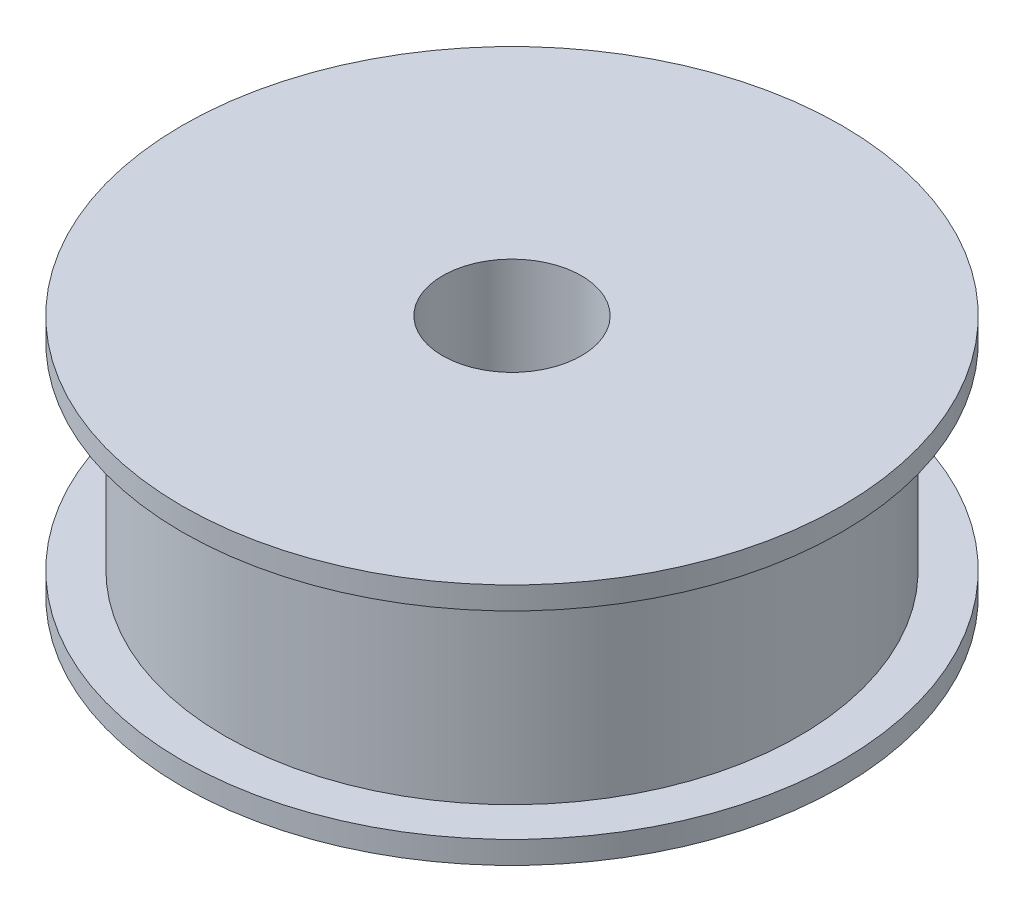
ISO-10303-21;
HEADER;
FILE_DESCRIPTION(('STEP AP214'),'2;1');
FILE_NAME('part.step','',(''),(''),'','','');
FILE_SCHEMA(('AUTOMOTIVE_DESIGN { 1 0 10303 214 1 1 1 1 }'));
ENDSEC;
DATA;
#1=APPLICATION_CONTEXT('core data for automotive mechanical design processes');
#2=APPLICATION_PROTOCOL_DEFINITION('international standard','automotive_design',2000,#1);
#3=PRODUCT_CONTEXT('',#1,'mechanical');
#4=PRODUCT('Part','Part','',(#3));
#5=PRODUCT_RELATED_PRODUCT_CATEGORY('part','',(#4));
#6=PRODUCT_DEFINITION_FORMATION('','',#4);
#7=PRODUCT_DEFINITION_CONTEXT('part definition',#1,'design');
#8=PRODUCT_DEFINITION('design','',#6,#7);
#9=PRODUCT_DEFINITION_SHAPE('','',#8);
#10=(LENGTH_UNIT() NAMED_UNIT(*) SI_UNIT(.MILLI.,.METRE.));
#11=(NAMED_UNIT(*) PLANE_ANGLE_UNIT() SI_UNIT($,.RADIAN.));
#12=(NAMED_UNIT(*) SI_UNIT($,.STERADIAN.) SOLID_ANGLE_UNIT());
#13=UNCERTAINTY_MEASURE_WITH_UNIT(LENGTH_MEASURE(1.E-05),#10,'distance_accuracy_value','');
#14=(GEOMETRIC_REPRESENTATION_CONTEXT(3) GLOBAL_UNCERTAINTY_ASSIGNED_CONTEXT((#13)) GLOBAL_UNIT_ASSIGNED_CONTEXT((#10,
#11,#12)) REPRESENTATION_CONTEXT('',''));
#15=CARTESIAN_POINT('',(0.,0.,0.));
#16=DIRECTION('',(0.,0.,1.));
#17=DIRECTION('',(1.,0.,0.));
#18=AXIS2_PLACEMENT_3D('',#15,#16,#17);
#19=CARTESIAN_POINT('',(0.,7.7,0.));
#20=DIRECTION('',(0.,1.,0.));
#21=DIRECTION('',(0.,0.,1.));
#22=AXIS2_PLACEMENT_3D('',#19,#20,#21);
#23=CYLINDRICAL_SURFACE('',#22,19.);
#24=CARTESIAN_POINT('',(0.,-7.,0.));
#25=DIRECTION('',(0.,1.,0.));
#26=DIRECTION('',(0.,0.,1.));
#27=AXIS2_PLACEMENT_3D('',#24,#25,#26);
#28=CIRCLE('',#27,19.);
#29=CARTESIAN_POINT('',(0.,-7.,19.));
#30=VERTEX_POINT('',#29);
#31=EDGE_CURVE('E72',#30,#30,#28,.T.);
#32=ORIENTED_EDGE('',*,*,#31,.T.);
#33=EDGE_LOOP('',(#32));
#34=FACE_BOUND('',#33,.T.);
#35=CARTESIAN_POINT('',(0.,-5.7,0.));
#36=DIRECTION('',(0.,1.,0.));
#37=DIRECTION('',(0.,0.,1.));
#38=AXIS2_PLACEMENT_3D('',#35,#36,#37);
#39=CIRCLE('',#38,19.);
#40=CARTESIAN_POINT('',(0.,-5.7,19.));
#41=VERTEX_POINT('',#40);
#42=EDGE_CURVE('E10',#41,#41,#39,.T.);
#43=ORIENTED_EDGE('',*,*,#42,.F.);
#44=EDGE_LOOP('',(#43));
#45=FACE_BOUND('',#44,.T.);
#46=ADVANCED_FACE('F37',(#34,#45),#23,.T.);
#47=CARTESIAN_POINT('',(0.,-5.7,19.));
#48=DIRECTION('',(0.,1.,0.));
#49=DIRECTION('',(0.,0.,1.));
#50=AXIS2_PLACEMENT_3D('',#47,#48,#49);
#51=PLANE('',#50);
#52=ORIENTED_EDGE('',*,*,#42,.T.);
#53=EDGE_LOOP('',(#52));
#54=FACE_BOUND('',#53,.T.);
#55=CARTESIAN_POINT('',(0.,-5.7,0.));
#56=DIRECTION('',(0.,1.,0.));
#57=DIRECTION('',(0.,0.,1.));
#58=AXIS2_PLACEMENT_3D('',#55,#56,#57);
#59=CIRCLE('',#58,16.55);
#60=CARTESIAN_POINT('',(0.,-5.7,16.55));
#61=VERTEX_POINT('',#60);
#62=EDGE_CURVE('E44',#61,#61,#59,.T.);
#63=ORIENTED_EDGE('',*,*,#62,.F.);
#64=EDGE_LOOP('',(#63));
#65=FACE_BOUND('',#64,.T.);
#66=ADVANCED_FACE('F91',(#54,#65),#51,.T.);
#67=CARTESIAN_POINT('',(0.,7.7,0.));
#68=DIRECTION('',(0.,1.,0.));
#69=DIRECTION('',(0.,0.,1.));
#70=AXIS2_PLACEMENT_3D('',#67,#68,#69);
#71=CYLINDRICAL_SURFACE('',#70,16.55);
#72=ORIENTED_EDGE('',*,*,#62,.T.);
#73=EDGE_LOOP('',(#72));
#74=FACE_BOUND('',#73,.T.);
#75=CARTESIAN_POINT('',(0.,5.7,0.));
#76=DIRECTION('',(0.,1.,0.));
#77=DIRECTION('',(0.,0.,1.));
#78=AXIS2_PLACEMENT_3D('',#75,#76,#77);
#79=CIRCLE('',#78,16.55);
#80=CARTESIAN_POINT('',(0.,5.7,16.55));
#81=VERTEX_POINT('',#80);
#82=EDGE_CURVE('E49',#81,#81,#79,.T.);
#83=ORIENTED_EDGE('',*,*,#82,.F.);
#84=EDGE_LOOP('',(#83));
#85=FACE_BOUND('',#84,.T.);
#86=ADVANCED_FACE('F95',(#74,#85),#71,.T.);
#87=CARTESIAN_POINT('',(0.,5.7,19.));
#88=DIRECTION('',(0.,-1.,0.));
#89=DIRECTION('',(0.,0.,-1.));
#90=AXIS2_PLACEMENT_3D('',#87,#88,#89);
#91=PLANE('',#90);
#92=ORIENTED_EDGE('',*,*,#82,.T.);
#93=EDGE_LOOP('',(#92));
#94=FACE_BOUND('',#93,.T.);
#95=CARTESIAN_POINT('',(0.,5.7,0.));
#96=DIRECTION('',(0.,1.,0.));
#97=DIRECTION('',(0.,0.,1.));
#98=AXIS2_PLACEMENT_3D('',#95,#96,#97);
#99=CIRCLE('',#98,19.);
#100=CARTESIAN_POINT('',(0.,5.7,19.));
#101=VERTEX_POINT('',#100);
#102=EDGE_CURVE('E54',#101,#101,#99,.T.);
#103=ORIENTED_EDGE('',*,*,#102,.F.);
#104=EDGE_LOOP('',(#103));
#105=FACE_BOUND('',#104,.T.);
#106=ADVANCED_FACE('F99',(#94,#105),#91,.T.);
#107=CARTESIAN_POINT('',(0.,7.7,0.));
#108=DIRECTION('',(0.,1.,0.));
#109=DIRECTION('',(0.,0.,1.));
#110=AXIS2_PLACEMENT_3D('',#107,#108,#109);
#111=CYLINDRICAL_SURFACE('',#110,19.);
#112=ORIENTED_EDGE('',*,*,#102,.T.);
#113=EDGE_LOOP('',(#112));
#114=FACE_BOUND('',#113,.T.);
#115=CARTESIAN_POINT('',(0.,7.,0.));
#116=DIRECTION('',(0.,1.,0.));
#117=DIRECTION('',(0.,0.,1.));
#118=AXIS2_PLACEMENT_3D('',#115,#116,#117);
#119=CIRCLE('',#118,19.);
#120=CARTESIAN_POINT('',(0.,7.,19.));
#121=VERTEX_POINT('',#120);
#122=EDGE_CURVE('E60',#121,#121,#119,.T.);
#123=ORIENTED_EDGE('',*,*,#122,.F.);
#124=EDGE_LOOP('',(#123));
#125=FACE_BOUND('',#124,.T.);
#126=ADVANCED_FACE('F105',(#114,#125),#111,.T.);
#127=CARTESIAN_POINT('',(0.,7.,4.));
#128=DIRECTION('',(0.,1.,0.));
#129=DIRECTION('',(0.,0.,1.));
#130=AXIS2_PLACEMENT_3D('',#127,#128,#129);
#131=PLANE('',#130);
#132=ORIENTED_EDGE('',*,*,#122,.T.);
#133=EDGE_LOOP('',(#132));
#134=FACE_BOUND('',#133,.T.);
#135=CARTESIAN_POINT('',(0.,7.,0.));
#136=DIRECTION('',(0.,1.,0.));
#137=DIRECTION('',(0.,0.,1.));
#138=AXIS2_PLACEMENT_3D('',#135,#136,#137);
#139=CIRCLE('',#138,4.);
#140=CARTESIAN_POINT('',(0.,7.,4.));
#141=VERTEX_POINT('',#140);
#142=EDGE_CURVE('E64',#141,#141,#139,.T.);
#143=ORIENTED_EDGE('',*,*,#142,.F.);
#144=EDGE_LOOP('',(#143));
#145=FACE_BOUND('',#144,.T.);
#146=ADVANCED_FACE('F87',(#134,#145),#131,.T.);
#147=CARTESIAN_POINT('',(0.,7.7,0.));
#148=DIRECTION('',(0.,1.,0.));
#149=DIRECTION('',(0.,0.,1.));
#150=AXIS2_PLACEMENT_3D('',#147,#148,#149);
#151=CYLINDRICAL_SURFACE('',#150,4.);
#152=ORIENTED_EDGE('',*,*,#142,.T.);
#153=EDGE_LOOP('',(#152));
#154=FACE_BOUND('',#153,.T.);
#155=CARTESIAN_POINT('',(0.,-7.,0.));
#156=DIRECTION('',(0.,1.,0.));
#157=DIRECTION('',(0.,0.,1.));
#158=AXIS2_PLACEMENT_3D('',#155,#156,#157);
#159=CIRCLE('',#158,4.);
#160=CARTESIAN_POINT('',(0.,-7.,4.));
#161=VERTEX_POINT('',#160);
#162=EDGE_CURVE('E68',#161,#161,#159,.T.);
#163=ORIENTED_EDGE('',*,*,#162,.F.);
#164=EDGE_LOOP('',(#163));
#165=FACE_BOUND('',#164,.T.);
#166=ADVANCED_FACE('F81',(#154,#165),#151,.F.);
#167=CARTESIAN_POINT('',(0.,-7.,4.));
#168=DIRECTION('',(0.,-1.,0.));
#169=DIRECTION('',(0.,0.,-1.));
#170=AXIS2_PLACEMENT_3D('',#167,#168,#169);
#171=PLANE('',#170);
#172=ORIENTED_EDGE('',*,*,#162,.T.);
#173=EDGE_LOOP('',(#172));
#174=FACE_BOUND('',#173,.T.);
#175=ORIENTED_EDGE('',*,*,#31,.F.);
#176=EDGE_LOOP('',(#175));
#177=FACE_BOUND('',#176,.T.);
#178=ADVANCED_FACE('F79',(#174,#177),#171,.T.);
#179=CLOSED_SHELL('',(#46,#66,#86,#106,#126,#146,#166,#178));
#180=MANIFOLD_SOLID_BREP('B2',#179);
#181=ADVANCED_BREP_SHAPE_REPRESENTATION('',(#18,#180),#14);
#182=SHAPE_DEFINITION_REPRESENTATION(#9,#181);
ENDSEC;
END-ISO-10303-21;
